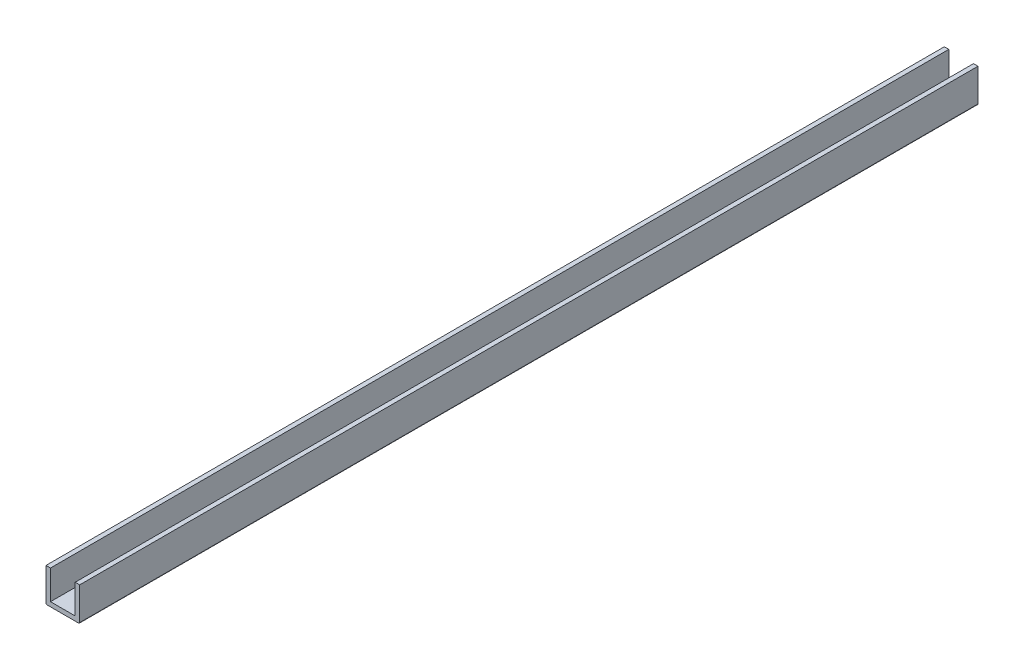
ISO-10303-21;
HEADER;
FILE_DESCRIPTION(('STEP AP214'),'2;1');
FILE_NAME('part.step','',(''),(''),'','','');
FILE_SCHEMA(('AUTOMOTIVE_DESIGN { 1 0 10303 214 1 1 1 1 }'));
ENDSEC;
DATA;
#1=APPLICATION_CONTEXT('core data for automotive mechanical design processes');
#2=APPLICATION_PROTOCOL_DEFINITION('international standard','automotive_design',2000,#1);
#3=PRODUCT_CONTEXT('',#1,'mechanical');
#4=PRODUCT('Part','Part','',(#3));
#5=PRODUCT_RELATED_PRODUCT_CATEGORY('part','',(#4));
#6=PRODUCT_DEFINITION_FORMATION('','',#4);
#7=PRODUCT_DEFINITION_CONTEXT('part definition',#1,'design');
#8=PRODUCT_DEFINITION('design','',#6,#7);
#9=PRODUCT_DEFINITION_SHAPE('','',#8);
#10=(LENGTH_UNIT() NAMED_UNIT(*) SI_UNIT(.MILLI.,.METRE.));
#11=(NAMED_UNIT(*) PLANE_ANGLE_UNIT() SI_UNIT($,.RADIAN.));
#12=(NAMED_UNIT(*) SI_UNIT($,.STERADIAN.) SOLID_ANGLE_UNIT());
#13=UNCERTAINTY_MEASURE_WITH_UNIT(LENGTH_MEASURE(1.E-05),#10,'distance_accuracy_value','');
#14=(GEOMETRIC_REPRESENTATION_CONTEXT(3) GLOBAL_UNCERTAINTY_ASSIGNED_CONTEXT((#13)) GLOBAL_UNIT_ASSIGNED_CONTEXT((#10,
#11,#12)) REPRESENTATION_CONTEXT('',''));
#15=CARTESIAN_POINT('',(0.,0.,0.));
#16=DIRECTION('',(0.,0.,1.));
#17=DIRECTION('',(1.,0.,0.));
#18=AXIS2_PLACEMENT_3D('',#15,#16,#17);
#19=CARTESIAN_POINT('',(-5.5,15.,400.));
#20=DIRECTION('',(0.,-1.,0.));
#21=DIRECTION('',(0.,0.,-1.));
#22=AXIS2_PLACEMENT_3D('',#19,#20,#21);
#23=PLANE('',#22);
#24=DIRECTION('',(-1.,0.,0.));
#25=VECTOR('',#24,1.);
#26=CARTESIAN_POINT('',(-5.5,15.,0.));
#27=LINE('',#26,#25);
#28=CARTESIAN_POINT('',(-5.5,15.,0.));
#29=VERTEX_POINT('',#28);
#30=CARTESIAN_POINT('',(-7.5,15.,0.));
#31=VERTEX_POINT('',#30);
#32=EDGE_CURVE('E131',#29,#31,#27,.T.);
#33=ORIENTED_EDGE('',*,*,#32,.T.);
#34=DIRECTION('',(0.,0.,-1.));
#35=VECTOR('',#34,1.);
#36=CARTESIAN_POINT('',(-7.5,15.,400.));
#37=LINE('',#36,#35);
#38=CARTESIAN_POINT('',(-7.5,15.,400.));
#39=VERTEX_POINT('',#38);
#40=EDGE_CURVE('E114',#39,#31,#37,.T.);
#41=ORIENTED_EDGE('',*,*,#40,.F.);
#42=DIRECTION('',(-1.,0.,0.));
#43=VECTOR('',#42,1.);
#44=CARTESIAN_POINT('',(-5.5,15.,400.));
#45=LINE('',#44,#43);
#46=CARTESIAN_POINT('',(-5.5,15.,400.));
#47=VERTEX_POINT('',#46);
#48=EDGE_CURVE('E119',#47,#39,#45,.T.);
#49=ORIENTED_EDGE('',*,*,#48,.F.);
#50=DIRECTION('',(0.,0.,-1.));
#51=VECTOR('',#50,1.);
#52=CARTESIAN_POINT('',(-5.5,15.,400.));
#53=LINE('',#52,#51);
#54=EDGE_CURVE('E229',#47,#29,#53,.T.);
#55=ORIENTED_EDGE('',*,*,#54,.T.);
#56=EDGE_LOOP('',(#33,#41,#49,#55));
#57=FACE_BOUND('',#56,.T.);
#58=ADVANCED_FACE('F32',(#57),#23,.F.);
#59=CARTESIAN_POINT('',(-7.5,15.,400.));
#60=DIRECTION('',(1.,0.,0.));
#61=DIRECTION('',(0.,1.,0.));
#62=AXIS2_PLACEMENT_3D('',#59,#60,#61);
#63=PLANE('',#62);
#64=DIRECTION('',(0.,-1.,0.));
#65=VECTOR('',#64,1.);
#66=CARTESIAN_POINT('',(-7.5,15.,0.));
#67=LINE('',#66,#65);
#68=CARTESIAN_POINT('',(-7.5,0.5,0.));
#69=VERTEX_POINT('',#68);
#70=EDGE_CURVE('E231',#31,#69,#67,.T.);
#71=ORIENTED_EDGE('',*,*,#70,.T.);
#72=DIRECTION('',(0.,0.,-1.));
#73=VECTOR('',#72,1.);
#74=CARTESIAN_POINT('',(-7.5,0.5,400.));
#75=LINE('',#74,#73);
#76=CARTESIAN_POINT('',(-7.5,0.5,400.));
#77=VERTEX_POINT('',#76);
#78=EDGE_CURVE('E11',#69,#77,#75,.F.);
#79=ORIENTED_EDGE('',*,*,#78,.T.);
#80=DIRECTION('',(0.,-1.,0.));
#81=VECTOR('',#80,1.);
#82=CARTESIAN_POINT('',(-7.5,15.,400.));
#83=LINE('',#82,#81);
#84=EDGE_CURVE('E110',#39,#77,#83,.T.);
#85=ORIENTED_EDGE('',*,*,#84,.F.);
#86=ORIENTED_EDGE('',*,*,#40,.T.);
#87=EDGE_LOOP('',(#71,#79,#85,#86));
#88=FACE_BOUND('',#87,.T.);
#89=ADVANCED_FACE('F112',(#88),#63,.F.);
#90=CARTESIAN_POINT('',(-7.5,0.,400.));
#91=DIRECTION('',(0.,1.,0.));
#92=DIRECTION('',(-1.,0.,0.));
#93=AXIS2_PLACEMENT_3D('',#90,#91,#92);
#94=PLANE('',#93);
#95=CARTESIAN_POINT('',(0.,0.,30.0000000000001));
#96=DIRECTION('',(0.,-1.,0.));
#97=DIRECTION('',(1.,0.,0.));
#98=AXIS2_PLACEMENT_3D('',#95,#96,#97);
#99=CIRCLE('',#98,2.);
#100=CARTESIAN_POINT('',(2.,0.,30.0000000000001));
#101=VERTEX_POINT('',#100);
#102=EDGE_CURVE('E200',#101,#101,#99,.T.);
#103=ORIENTED_EDGE('',*,*,#102,.F.);
#104=EDGE_LOOP('',(#103));
#105=FACE_BOUND('',#104,.T.);
#106=CARTESIAN_POINT('',(0.,0.,80.0000000000001));
#107=DIRECTION('',(0.,-1.,0.));
#108=DIRECTION('',(1.,0.,0.));
#109=AXIS2_PLACEMENT_3D('',#106,#107,#108);
#110=CIRCLE('',#109,2.);
#111=CARTESIAN_POINT('',(2.,0.,80.0000000000001));
#112=VERTEX_POINT('',#111);
#113=EDGE_CURVE('E190',#112,#112,#110,.T.);
#114=ORIENTED_EDGE('',*,*,#113,.F.);
#115=EDGE_LOOP('',(#114));
#116=FACE_BOUND('',#115,.T.);
#117=CARTESIAN_POINT('',(0.,0.,130.));
#118=DIRECTION('',(0.,-1.,0.));
#119=DIRECTION('',(1.,0.,0.));
#120=AXIS2_PLACEMENT_3D('',#117,#118,#119);
#121=CIRCLE('',#120,2.);
#122=CARTESIAN_POINT('',(2.,0.,130.));
#123=VERTEX_POINT('',#122);
#124=EDGE_CURVE('E187',#123,#123,#121,.T.);
#125=ORIENTED_EDGE('',*,*,#124,.F.);
#126=EDGE_LOOP('',(#125));
#127=FACE_BOUND('',#126,.T.);
#128=CARTESIAN_POINT('',(0.,0.,180.));
#129=DIRECTION('',(0.,-1.,0.));
#130=DIRECTION('',(1.,0.,0.));
#131=AXIS2_PLACEMENT_3D('',#128,#129,#130);
#132=CIRCLE('',#131,2.);
#133=CARTESIAN_POINT('',(2.,0.,180.));
#134=VERTEX_POINT('',#133);
#135=EDGE_CURVE('E184',#134,#134,#132,.T.);
#136=ORIENTED_EDGE('',*,*,#135,.F.);
#137=EDGE_LOOP('',(#136));
#138=FACE_BOUND('',#137,.T.);
#139=CARTESIAN_POINT('',(0.,0.,230.));
#140=DIRECTION('',(0.,-1.,0.));
#141=DIRECTION('',(1.,0.,0.));
#142=AXIS2_PLACEMENT_3D('',#139,#140,#141);
#143=CIRCLE('',#142,2.);
#144=CARTESIAN_POINT('',(2.,0.,230.));
#145=VERTEX_POINT('',#144);
#146=EDGE_CURVE('E180',#145,#145,#143,.T.);
#147=ORIENTED_EDGE('',*,*,#146,.F.);
#148=EDGE_LOOP('',(#147));
#149=FACE_BOUND('',#148,.T.);
#150=CARTESIAN_POINT('',(0.,0.,20.));
#151=DIRECTION('',(0.,-1.,0.));
#152=DIRECTION('',(1.,0.,0.));
#153=AXIS2_PLACEMENT_3D('',#150,#151,#152);
#154=CIRCLE('',#153,1.75);
#155=CARTESIAN_POINT('',(1.75,0.,20.));
#156=VERTEX_POINT('',#155);
#157=EDGE_CURVE('E176',#156,#156,#154,.T.);
#158=ORIENTED_EDGE('',*,*,#157,.F.);
#159=EDGE_LOOP('',(#158));
#160=FACE_BOUND('',#159,.T.);
#161=CARTESIAN_POINT('',(0.,0.,380.));
#162=DIRECTION('',(0.,-1.,0.));
#163=DIRECTION('',(1.,0.,0.));
#164=AXIS2_PLACEMENT_3D('',#161,#162,#163);
#165=CIRCLE('',#164,1.75);
#166=CARTESIAN_POINT('',(1.75,0.,380.));
#167=VERTEX_POINT('',#166);
#168=EDGE_CURVE('E172',#167,#167,#165,.T.);
#169=ORIENTED_EDGE('',*,*,#168,.F.);
#170=EDGE_LOOP('',(#169));
#171=FACE_BOUND('',#170,.T.);
#172=CARTESIAN_POINT('',(0.,0.,390.));
#173=DIRECTION('',(0.,-1.,0.));
#174=DIRECTION('',(1.,0.,0.));
#175=AXIS2_PLACEMENT_3D('',#172,#173,#174);
#176=CIRCLE('',#175,1.75);
#177=CARTESIAN_POINT('',(1.75,0.,390.));
#178=VERTEX_POINT('',#177);
#179=EDGE_CURVE('E168',#178,#178,#176,.T.);
#180=ORIENTED_EDGE('',*,*,#179,.F.);
#181=EDGE_LOOP('',(#180));
#182=FACE_BOUND('',#181,.T.);
#183=CARTESIAN_POINT('',(0.,0.,10.));
#184=DIRECTION('',(0.,-1.,0.));
#185=DIRECTION('',(1.,0.,0.));
#186=AXIS2_PLACEMENT_3D('',#183,#184,#185);
#187=CIRCLE('',#186,1.75);
#188=CARTESIAN_POINT('',(1.75,0.,10.));
#189=VERTEX_POINT('',#188);
#190=EDGE_CURVE('E164',#189,#189,#187,.T.);
#191=ORIENTED_EDGE('',*,*,#190,.F.);
#192=EDGE_LOOP('',(#191));
#193=FACE_BOUND('',#192,.T.);
#194=CARTESIAN_POINT('',(0.,0.,330.));
#195=DIRECTION('',(0.,-1.,0.));
#196=DIRECTION('',(1.,0.,0.));
#197=AXIS2_PLACEMENT_3D('',#194,#195,#196);
#198=CIRCLE('',#197,2.);
#199=CARTESIAN_POINT('',(2.,0.,330.));
#200=VERTEX_POINT('',#199);
#201=EDGE_CURVE('E160',#200,#200,#198,.T.);
#202=ORIENTED_EDGE('',*,*,#201,.F.);
#203=EDGE_LOOP('',(#202));
#204=FACE_BOUND('',#203,.T.);
#205=CARTESIAN_POINT('',(0.,0.,280.));
#206=DIRECTION('',(0.,-1.,0.));
#207=DIRECTION('',(1.,0.,0.));
#208=AXIS2_PLACEMENT_3D('',#205,#206,#207);
#209=CIRCLE('',#208,2.);
#210=CARTESIAN_POINT('',(2.,0.,280.));
#211=VERTEX_POINT('',#210);
#212=EDGE_CURVE('E156',#211,#211,#209,.T.);
#213=ORIENTED_EDGE('',*,*,#212,.F.);
#214=EDGE_LOOP('',(#213));
#215=FACE_BOUND('',#214,.T.);
#216=DIRECTION('',(1.,0.,0.));
#217=VECTOR('',#216,1.);
#218=CARTESIAN_POINT('',(-7.5,0.,0.));
#219=LINE('',#218,#217);
#220=CARTESIAN_POINT('',(-7.,0.,0.));
#221=VERTEX_POINT('',#220);
#222=CARTESIAN_POINT('',(7.,0.,0.));
#223=VERTEX_POINT('',#222);
#224=EDGE_CURVE('E233',#221,#223,#219,.T.);
#225=ORIENTED_EDGE('',*,*,#224,.T.);
#226=DIRECTION('',(0.,0.,-1.));
#227=VECTOR('',#226,1.);
#228=CARTESIAN_POINT('',(7.,0.,400.));
#229=LINE('',#228,#227);
#230=CARTESIAN_POINT('',(7.,0.,400.));
#231=VERTEX_POINT('',#230);
#232=EDGE_CURVE('E55',#223,#231,#229,.F.);
#233=ORIENTED_EDGE('',*,*,#232,.T.);
#234=DIRECTION('',(1.,0.,0.));
#235=VECTOR('',#234,1.);
#236=CARTESIAN_POINT('',(-7.5,0.,400.));
#237=LINE('',#236,#235);
#238=CARTESIAN_POINT('',(-7.,0.,400.));
#239=VERTEX_POINT('',#238);
#240=EDGE_CURVE('E118',#239,#231,#237,.T.);
#241=ORIENTED_EDGE('',*,*,#240,.F.);
#242=DIRECTION('',(0.,0.,-1.));
#243=VECTOR('',#242,1.);
#244=CARTESIAN_POINT('',(-7.,0.,400.));
#245=LINE('',#244,#243);
#246=EDGE_CURVE('E146',#239,#221,#245,.T.);
#247=ORIENTED_EDGE('',*,*,#246,.T.);
#248=EDGE_LOOP('',(#225,#233,#241,#247));
#249=FACE_BOUND('',#248,.T.);
#250=ADVANCED_FACE('F275',(#105,#116,#127,#138,#149,#160,#171,#182,#193,#204,#215,#249),#94,.F.);
#251=CARTESIAN_POINT('',(7.5,0.,400.));
#252=DIRECTION('',(-1.,0.,0.));
#253=DIRECTION('',(0.,0.,1.));
#254=AXIS2_PLACEMENT_3D('',#251,#252,#253);
#255=PLANE('',#254);
#256=DIRECTION('',(0.,1.,0.));
#257=VECTOR('',#256,1.);
#258=CARTESIAN_POINT('',(7.5,0.,400.));
#259=LINE('',#258,#257);
#260=CARTESIAN_POINT('',(7.5,0.5,400.));
#261=VERTEX_POINT('',#260);
#262=CARTESIAN_POINT('',(7.5,15.,400.));
#263=VERTEX_POINT('',#262);
#264=EDGE_CURVE('E220',#261,#263,#259,.T.);
#265=ORIENTED_EDGE('',*,*,#264,.F.);
#266=DIRECTION('',(0.,0.,-1.));
#267=VECTOR('',#266,1.);
#268=CARTESIAN_POINT('',(7.5,0.5,400.));
#269=LINE('',#268,#267);
#270=CARTESIAN_POINT('',(7.5,0.5,0.));
#271=VERTEX_POINT('',#270);
#272=EDGE_CURVE('E132',#261,#271,#269,.T.);
#273=ORIENTED_EDGE('',*,*,#272,.T.);
#274=DIRECTION('',(0.,1.,0.));
#275=VECTOR('',#274,1.);
#276=CARTESIAN_POINT('',(7.5,0.,0.));
#277=LINE('',#276,#275);
#278=CARTESIAN_POINT('',(7.5,15.,0.));
#279=VERTEX_POINT('',#278);
#280=EDGE_CURVE('E235',#271,#279,#277,.T.);
#281=ORIENTED_EDGE('',*,*,#280,.T.);
#282=DIRECTION('',(0.,0.,-1.));
#283=VECTOR('',#282,1.);
#284=CARTESIAN_POINT('',(7.5,15.,400.));
#285=LINE('',#284,#283);
#286=EDGE_CURVE('E133',#263,#279,#285,.T.);
#287=ORIENTED_EDGE('',*,*,#286,.F.);
#288=EDGE_LOOP('',(#265,#273,#281,#287));
#289=FACE_BOUND('',#288,.T.);
#290=ADVANCED_FACE('F281',(#289),#255,.F.);
#291=CARTESIAN_POINT('',(7.5,15.,400.));
#292=DIRECTION('',(0.,-1.,0.));
#293=DIRECTION('',(0.,0.,-1.));
#294=AXIS2_PLACEMENT_3D('',#291,#292,#293);
#295=PLANE('',#294);
#296=DIRECTION('',(-1.,0.,0.));
#297=VECTOR('',#296,1.);
#298=CARTESIAN_POINT('',(7.5,15.,0.));
#299=LINE('',#298,#297);
#300=CARTESIAN_POINT('',(5.5,15.,0.));
#301=VERTEX_POINT('',#300);
#302=EDGE_CURVE('E237',#279,#301,#299,.T.);
#303=ORIENTED_EDGE('',*,*,#302,.T.);
#304=DIRECTION('',(0.,0.,-1.));
#305=VECTOR('',#304,1.);
#306=CARTESIAN_POINT('',(5.5,15.,400.));
#307=LINE('',#306,#305);
#308=CARTESIAN_POINT('',(5.5,15.,400.));
#309=VERTEX_POINT('',#308);
#310=EDGE_CURVE('E139',#309,#301,#307,.T.);
#311=ORIENTED_EDGE('',*,*,#310,.F.);
#312=DIRECTION('',(-1.,0.,0.));
#313=VECTOR('',#312,1.);
#314=CARTESIAN_POINT('',(7.5,15.,400.));
#315=LINE('',#314,#313);
#316=EDGE_CURVE('E222',#263,#309,#315,.T.);
#317=ORIENTED_EDGE('',*,*,#316,.F.);
#318=ORIENTED_EDGE('',*,*,#286,.T.);
#319=EDGE_LOOP('',(#303,#311,#317,#318));
#320=FACE_BOUND('',#319,.T.);
#321=ADVANCED_FACE('F283',(#320),#295,.F.);
#322=CARTESIAN_POINT('',(5.5,15.,400.));
#323=DIRECTION('',(1.,0.,0.));
#324=DIRECTION('',(0.,1.,0.));
#325=AXIS2_PLACEMENT_3D('',#322,#323,#324);
#326=PLANE('',#325);
#327=DIRECTION('',(0.,-1.,0.));
#328=VECTOR('',#327,1.);
#329=CARTESIAN_POINT('',(5.5,15.,0.));
#330=LINE('',#329,#328);
#331=CARTESIAN_POINT('',(5.5,2.,0.));
#332=VERTEX_POINT('',#331);
#333=EDGE_CURVE('E239',#301,#332,#330,.T.);
#334=ORIENTED_EDGE('',*,*,#333,.T.);
#335=DIRECTION('',(0.,0.,-1.));
#336=VECTOR('',#335,1.);
#337=CARTESIAN_POINT('',(5.5,2.,400.));
#338=LINE('',#337,#336);
#339=CARTESIAN_POINT('',(5.5,2.,400.));
#340=VERTEX_POINT('',#339);
#341=EDGE_CURVE('E248',#340,#332,#338,.T.);
#342=ORIENTED_EDGE('',*,*,#341,.F.);
#343=DIRECTION('',(0.,-1.,0.));
#344=VECTOR('',#343,1.);
#345=CARTESIAN_POINT('',(5.5,15.,400.));
#346=LINE('',#345,#344);
#347=EDGE_CURVE('E224',#309,#340,#346,.T.);
#348=ORIENTED_EDGE('',*,*,#347,.F.);
#349=ORIENTED_EDGE('',*,*,#310,.T.);
#350=EDGE_LOOP('',(#334,#342,#348,#349));
#351=FACE_BOUND('',#350,.T.);
#352=ADVANCED_FACE('F255',(#351),#326,.F.);
#353=CARTESIAN_POINT('',(5.5,2.,400.));
#354=DIRECTION('',(0.,-1.,0.));
#355=DIRECTION('',(1.,0.,0.));
#356=AXIS2_PLACEMENT_3D('',#353,#354,#355);
#357=PLANE('',#356);
#358=CARTESIAN_POINT('',(0.,2.,30.0000000000001));
#359=DIRECTION('',(0.,-1.,0.));
#360=DIRECTION('',(1.,0.,0.));
#361=AXIS2_PLACEMENT_3D('',#358,#359,#360);
#362=CIRCLE('',#361,2.);
#363=CARTESIAN_POINT('',(2.,2.,30.0000000000001));
#364=VERTEX_POINT('',#363);
#365=EDGE_CURVE('E36',#364,#364,#362,.T.);
#366=ORIENTED_EDGE('',*,*,#365,.T.);
#367=EDGE_LOOP('',(#366));
#368=FACE_BOUND('',#367,.T.);
#369=CARTESIAN_POINT('',(0.,2.,80.0000000000001));
#370=DIRECTION('',(0.,-1.,0.));
#371=DIRECTION('',(1.,0.,0.));
#372=AXIS2_PLACEMENT_3D('',#369,#370,#371);
#373=CIRCLE('',#372,2.);
#374=CARTESIAN_POINT('',(2.,2.,80.0000000000001));
#375=VERTEX_POINT('',#374);
#376=EDGE_CURVE('E188',#375,#375,#373,.T.);
#377=ORIENTED_EDGE('',*,*,#376,.T.);
#378=EDGE_LOOP('',(#377));
#379=FACE_BOUND('',#378,.T.);
#380=CARTESIAN_POINT('',(0.,2.,130.));
#381=DIRECTION('',(0.,-1.,0.));
#382=DIRECTION('',(1.,0.,0.));
#383=AXIS2_PLACEMENT_3D('',#380,#381,#382);
#384=CIRCLE('',#383,2.);
#385=CARTESIAN_POINT('',(2.,2.,130.));
#386=VERTEX_POINT('',#385);
#387=EDGE_CURVE('E185',#386,#386,#384,.T.);
#388=ORIENTED_EDGE('',*,*,#387,.T.);
#389=EDGE_LOOP('',(#388));
#390=FACE_BOUND('',#389,.T.);
#391=CARTESIAN_POINT('',(0.,2.,180.));
#392=DIRECTION('',(0.,-1.,0.));
#393=DIRECTION('',(1.,0.,0.));
#394=AXIS2_PLACEMENT_3D('',#391,#392,#393);
#395=CIRCLE('',#394,2.);
#396=CARTESIAN_POINT('',(2.,2.,180.));
#397=VERTEX_POINT('',#396);
#398=EDGE_CURVE('E181',#397,#397,#395,.T.);
#399=ORIENTED_EDGE('',*,*,#398,.T.);
#400=EDGE_LOOP('',(#399));
#401=FACE_BOUND('',#400,.T.);
#402=CARTESIAN_POINT('',(0.,2.,230.));
#403=DIRECTION('',(0.,-1.,0.));
#404=DIRECTION('',(1.,0.,0.));
#405=AXIS2_PLACEMENT_3D('',#402,#403,#404);
#406=CIRCLE('',#405,2.);
#407=CARTESIAN_POINT('',(2.,2.,230.));
#408=VERTEX_POINT('',#407);
#409=EDGE_CURVE('E177',#408,#408,#406,.T.);
#410=ORIENTED_EDGE('',*,*,#409,.T.);
#411=EDGE_LOOP('',(#410));
#412=FACE_BOUND('',#411,.T.);
#413=CARTESIAN_POINT('',(0.,2.,20.));
#414=DIRECTION('',(0.,-1.,0.));
#415=DIRECTION('',(1.,0.,0.));
#416=AXIS2_PLACEMENT_3D('',#413,#414,#415);
#417=CIRCLE('',#416,1.75);
#418=CARTESIAN_POINT('',(1.75,2.,20.));
#419=VERTEX_POINT('',#418);
#420=EDGE_CURVE('E173',#419,#419,#417,.T.);
#421=ORIENTED_EDGE('',*,*,#420,.T.);
#422=EDGE_LOOP('',(#421));
#423=FACE_BOUND('',#422,.T.);
#424=CARTESIAN_POINT('',(0.,2.,380.));
#425=DIRECTION('',(0.,-1.,0.));
#426=DIRECTION('',(1.,0.,0.));
#427=AXIS2_PLACEMENT_3D('',#424,#425,#426);
#428=CIRCLE('',#427,1.75);
#429=CARTESIAN_POINT('',(1.75,2.,380.));
#430=VERTEX_POINT('',#429);
#431=EDGE_CURVE('E169',#430,#430,#428,.T.);
#432=ORIENTED_EDGE('',*,*,#431,.T.);
#433=EDGE_LOOP('',(#432));
#434=FACE_BOUND('',#433,.T.);
#435=CARTESIAN_POINT('',(0.,2.,390.));
#436=DIRECTION('',(0.,-1.,0.));
#437=DIRECTION('',(1.,0.,0.));
#438=AXIS2_PLACEMENT_3D('',#435,#436,#437);
#439=CIRCLE('',#438,1.75);
#440=CARTESIAN_POINT('',(1.75,2.,390.));
#441=VERTEX_POINT('',#440);
#442=EDGE_CURVE('E165',#441,#441,#439,.T.);
#443=ORIENTED_EDGE('',*,*,#442,.T.);
#444=EDGE_LOOP('',(#443));
#445=FACE_BOUND('',#444,.T.);
#446=CARTESIAN_POINT('',(0.,2.,10.));
#447=DIRECTION('',(0.,-1.,0.));
#448=DIRECTION('',(1.,0.,0.));
#449=AXIS2_PLACEMENT_3D('',#446,#447,#448);
#450=CIRCLE('',#449,1.75);
#451=CARTESIAN_POINT('',(1.75,2.,10.));
#452=VERTEX_POINT('',#451);
#453=EDGE_CURVE('E161',#452,#452,#450,.T.);
#454=ORIENTED_EDGE('',*,*,#453,.T.);
#455=EDGE_LOOP('',(#454));
#456=FACE_BOUND('',#455,.T.);
#457=CARTESIAN_POINT('',(0.,2.,330.));
#458=DIRECTION('',(0.,-1.,0.));
#459=DIRECTION('',(1.,0.,0.));
#460=AXIS2_PLACEMENT_3D('',#457,#458,#459);
#461=CIRCLE('',#460,2.);
#462=CARTESIAN_POINT('',(2.,2.,330.));
#463=VERTEX_POINT('',#462);
#464=EDGE_CURVE('E157',#463,#463,#461,.T.);
#465=ORIENTED_EDGE('',*,*,#464,.T.);
#466=EDGE_LOOP('',(#465));
#467=FACE_BOUND('',#466,.T.);
#468=CARTESIAN_POINT('',(0.,2.,280.));
#469=DIRECTION('',(0.,-1.,0.));
#470=DIRECTION('',(1.,0.,0.));
#471=AXIS2_PLACEMENT_3D('',#468,#469,#470);
#472=CIRCLE('',#471,2.);
#473=CARTESIAN_POINT('',(2.,2.,280.));
#474=VERTEX_POINT('',#473);
#475=EDGE_CURVE('E153',#474,#474,#472,.T.);
#476=ORIENTED_EDGE('',*,*,#475,.T.);
#477=EDGE_LOOP('',(#476));
#478=FACE_BOUND('',#477,.T.);
#479=DIRECTION('',(-1.,0.,0.));
#480=VECTOR('',#479,1.);
#481=CARTESIAN_POINT('',(5.5,2.,0.));
#482=LINE('',#481,#480);
#483=CARTESIAN_POINT('',(-5.5,2.,0.));
#484=VERTEX_POINT('',#483);
#485=EDGE_CURVE('E241',#332,#484,#482,.T.);
#486=ORIENTED_EDGE('',*,*,#485,.T.);
#487=DIRECTION('',(0.,0.,-1.));
#488=VECTOR('',#487,1.);
#489=CARTESIAN_POINT('',(-5.5,2.,400.));
#490=LINE('',#489,#488);
#491=CARTESIAN_POINT('',(-5.5,2.,400.));
#492=VERTEX_POINT('',#491);
#493=EDGE_CURVE('E245',#492,#484,#490,.T.);
#494=ORIENTED_EDGE('',*,*,#493,.F.);
#495=DIRECTION('',(-1.,0.,0.));
#496=VECTOR('',#495,1.);
#497=CARTESIAN_POINT('',(5.5,2.,400.));
#498=LINE('',#497,#496);
#499=EDGE_CURVE('E226',#340,#492,#498,.T.);
#500=ORIENTED_EDGE('',*,*,#499,.F.);
#501=ORIENTED_EDGE('',*,*,#341,.T.);
#502=EDGE_LOOP('',(#486,#494,#500,#501));
#503=FACE_BOUND('',#502,.T.);
#504=ADVANCED_FACE('F267',(#368,#379,#390,#401,#412,#423,#434,#445,#456,#467,#478,#503),#357,.F.);
#505=CARTESIAN_POINT('',(-5.5,2.,400.));
#506=DIRECTION('',(-1.,0.,0.));
#507=DIRECTION('',(0.,0.,1.));
#508=AXIS2_PLACEMENT_3D('',#505,#506,#507);
#509=PLANE('',#508);
#510=DIRECTION('',(0.,1.,0.));
#511=VECTOR('',#510,1.);
#512=CARTESIAN_POINT('',(-5.5,2.,0.));
#513=LINE('',#512,#511);
#514=EDGE_CURVE('E128',#484,#29,#513,.T.);
#515=ORIENTED_EDGE('',*,*,#514,.T.);
#516=ORIENTED_EDGE('',*,*,#54,.F.);
#517=DIRECTION('',(0.,1.,0.));
#518=VECTOR('',#517,1.);
#519=CARTESIAN_POINT('',(-5.5,2.,400.));
#520=LINE('',#519,#518);
#521=EDGE_CURVE('E124',#492,#47,#520,.T.);
#522=ORIENTED_EDGE('',*,*,#521,.F.);
#523=ORIENTED_EDGE('',*,*,#493,.T.);
#524=EDGE_LOOP('',(#515,#516,#522,#523));
#525=FACE_BOUND('',#524,.T.);
#526=ADVANCED_FACE('F270',(#525),#509,.F.);
#527=CARTESIAN_POINT('',(0.,0.,400.));
#528=DIRECTION('',(0.,0.,1.));
#529=DIRECTION('',(1.,0.,0.));
#530=AXIS2_PLACEMENT_3D('',#527,#528,#529);
#531=PLANE('',#530);
#532=ORIENTED_EDGE('',*,*,#240,.T.);
#533=CARTESIAN_POINT('',(7.,0.5,400.));
#534=DIRECTION('',(0.,0.,1.));
#535=DIRECTION('',(1.,0.,0.));
#536=AXIS2_PLACEMENT_3D('',#533,#534,#535);
#537=CIRCLE('',#536,0.5);
#538=EDGE_CURVE('E41',#231,#261,#537,.T.);
#539=ORIENTED_EDGE('',*,*,#538,.T.);
#540=ORIENTED_EDGE('',*,*,#264,.T.);
#541=ORIENTED_EDGE('',*,*,#316,.T.);
#542=ORIENTED_EDGE('',*,*,#347,.T.);
#543=ORIENTED_EDGE('',*,*,#499,.T.);
#544=ORIENTED_EDGE('',*,*,#521,.T.);
#545=ORIENTED_EDGE('',*,*,#48,.T.);
#546=ORIENTED_EDGE('',*,*,#84,.T.);
#547=CARTESIAN_POINT('',(-7.,0.5,400.));
#548=DIRECTION('',(0.,0.,1.));
#549=DIRECTION('',(1.,0.,0.));
#550=AXIS2_PLACEMENT_3D('',#547,#548,#549);
#551=CIRCLE('',#550,0.5);
#552=EDGE_CURVE('E150',#77,#239,#551,.T.);
#553=ORIENTED_EDGE('',*,*,#552,.T.);
#554=EDGE_LOOP('',(#532,#539,#540,#541,#542,#543,#544,#545,#546,#553));
#555=FACE_BOUND('',#554,.T.);
#556=ADVANCED_FACE('F122',(#555),#531,.T.);
#557=CARTESIAN_POINT('',(0.,0.,0.));
#558=DIRECTION('',(0.,0.,1.));
#559=DIRECTION('',(1.,0.,0.));
#560=AXIS2_PLACEMENT_3D('',#557,#558,#559);
#561=PLANE('',#560);
#562=ORIENTED_EDGE('',*,*,#280,.F.);
#563=CARTESIAN_POINT('',(7.,0.5,0.));
#564=DIRECTION('',(0.,0.,1.));
#565=DIRECTION('',(1.,0.,0.));
#566=AXIS2_PLACEMENT_3D('',#563,#564,#565);
#567=CIRCLE('',#566,0.5);
#568=EDGE_CURVE('E144',#271,#223,#567,.F.);
#569=ORIENTED_EDGE('',*,*,#568,.T.);
#570=ORIENTED_EDGE('',*,*,#224,.F.);
#571=CARTESIAN_POINT('',(-7.,0.5,0.));
#572=DIRECTION('',(0.,0.,1.));
#573=DIRECTION('',(1.,0.,0.));
#574=AXIS2_PLACEMENT_3D('',#571,#572,#573);
#575=CIRCLE('',#574,0.5);
#576=EDGE_CURVE('E136',#221,#69,#575,.F.);
#577=ORIENTED_EDGE('',*,*,#576,.T.);
#578=ORIENTED_EDGE('',*,*,#70,.F.);
#579=ORIENTED_EDGE('',*,*,#32,.F.);
#580=ORIENTED_EDGE('',*,*,#514,.F.);
#581=ORIENTED_EDGE('',*,*,#485,.F.);
#582=ORIENTED_EDGE('',*,*,#333,.F.);
#583=ORIENTED_EDGE('',*,*,#302,.F.);
#584=EDGE_LOOP('',(#562,#569,#570,#577,#578,#579,#580,#581,#582,#583));
#585=FACE_BOUND('',#584,.T.);
#586=ADVANCED_FACE('F263',(#585),#561,.F.);
#587=CARTESIAN_POINT('',(7.,0.5,400.));
#588=DIRECTION('',(0.,0.,-1.));
#589=DIRECTION('',(-1.,0.,0.));
#590=AXIS2_PLACEMENT_3D('',#587,#588,#589);
#591=CYLINDRICAL_SURFACE('',#590,0.5);
#592=ORIENTED_EDGE('',*,*,#538,.F.);
#593=ORIENTED_EDGE('',*,*,#232,.F.);
#594=ORIENTED_EDGE('',*,*,#568,.F.);
#595=ORIENTED_EDGE('',*,*,#272,.F.);
#596=EDGE_LOOP('',(#592,#593,#594,#595));
#597=FACE_BOUND('',#596,.T.);
#598=ADVANCED_FACE('F278',(#597),#591,.T.);
#599=CARTESIAN_POINT('',(-7.,0.5,400.));
#600=DIRECTION('',(0.,0.,-1.));
#601=DIRECTION('',(-1.,0.,0.));
#602=AXIS2_PLACEMENT_3D('',#599,#600,#601);
#603=CYLINDRICAL_SURFACE('',#602,0.5);
#604=ORIENTED_EDGE('',*,*,#552,.F.);
#605=ORIENTED_EDGE('',*,*,#78,.F.);
#606=ORIENTED_EDGE('',*,*,#576,.F.);
#607=ORIENTED_EDGE('',*,*,#246,.F.);
#608=EDGE_LOOP('',(#604,#605,#606,#607));
#609=FACE_BOUND('',#608,.T.);
#610=ADVANCED_FACE('F34',(#609),#603,.T.);
#611=CARTESIAN_POINT('',(0.,15.,280.));
#612=DIRECTION('',(0.,-1.,0.));
#613=DIRECTION('',(1.,0.,0.));
#614=AXIS2_PLACEMENT_3D('',#611,#612,#613);
#615=CYLINDRICAL_SURFACE('',#614,2.);
#616=ORIENTED_EDGE('',*,*,#212,.T.);
#617=EDGE_LOOP('',(#616));
#618=FACE_BOUND('',#617,.T.);
#619=ORIENTED_EDGE('',*,*,#475,.F.);
#620=EDGE_LOOP('',(#619));
#621=FACE_BOUND('',#620,.T.);
#622=ADVANCED_FACE('F304',(#618,#621),#615,.F.);
#623=CARTESIAN_POINT('',(0.,15.,330.));
#624=DIRECTION('',(0.,-1.,0.));
#625=DIRECTION('',(1.,0.,0.));
#626=AXIS2_PLACEMENT_3D('',#623,#624,#625);
#627=CYLINDRICAL_SURFACE('',#626,2.);
#628=ORIENTED_EDGE('',*,*,#201,.T.);
#629=EDGE_LOOP('',(#628));
#630=FACE_BOUND('',#629,.T.);
#631=ORIENTED_EDGE('',*,*,#464,.F.);
#632=EDGE_LOOP('',(#631));
#633=FACE_BOUND('',#632,.T.);
#634=ADVANCED_FACE('F339',(#630,#633),#627,.F.);
#635=CARTESIAN_POINT('',(0.,15.,10.));
#636=DIRECTION('',(0.,-1.,0.));
#637=DIRECTION('',(1.,0.,0.));
#638=AXIS2_PLACEMENT_3D('',#635,#636,#637);
#639=CYLINDRICAL_SURFACE('',#638,1.75);
#640=ORIENTED_EDGE('',*,*,#190,.T.);
#641=EDGE_LOOP('',(#640));
#642=FACE_BOUND('',#641,.T.);
#643=ORIENTED_EDGE('',*,*,#453,.F.);
#644=EDGE_LOOP('',(#643));
#645=FACE_BOUND('',#644,.T.);
#646=ADVANCED_FACE('F344',(#642,#645),#639,.F.);
#647=CARTESIAN_POINT('',(0.,15.,390.));
#648=DIRECTION('',(0.,-1.,0.));
#649=DIRECTION('',(1.,0.,0.));
#650=AXIS2_PLACEMENT_3D('',#647,#648,#649);
#651=CYLINDRICAL_SURFACE('',#650,1.75);
#652=ORIENTED_EDGE('',*,*,#179,.T.);
#653=EDGE_LOOP('',(#652));
#654=FACE_BOUND('',#653,.T.);
#655=ORIENTED_EDGE('',*,*,#442,.F.);
#656=EDGE_LOOP('',(#655));
#657=FACE_BOUND('',#656,.T.);
#658=ADVANCED_FACE('F350',(#654,#657),#651,.F.);
#659=CARTESIAN_POINT('',(0.,15.,380.));
#660=DIRECTION('',(0.,-1.,0.));
#661=DIRECTION('',(1.,0.,0.));
#662=AXIS2_PLACEMENT_3D('',#659,#660,#661);
#663=CYLINDRICAL_SURFACE('',#662,1.75);
#664=ORIENTED_EDGE('',*,*,#168,.T.);
#665=EDGE_LOOP('',(#664));
#666=FACE_BOUND('',#665,.T.);
#667=ORIENTED_EDGE('',*,*,#431,.F.);
#668=EDGE_LOOP('',(#667));
#669=FACE_BOUND('',#668,.T.);
#670=ADVANCED_FACE('F354',(#666,#669),#663,.F.);
#671=CARTESIAN_POINT('',(0.,15.,20.));
#672=DIRECTION('',(0.,-1.,0.));
#673=DIRECTION('',(1.,0.,0.));
#674=AXIS2_PLACEMENT_3D('',#671,#672,#673);
#675=CYLINDRICAL_SURFACE('',#674,1.75);
#676=ORIENTED_EDGE('',*,*,#157,.T.);
#677=EDGE_LOOP('',(#676));
#678=FACE_BOUND('',#677,.T.);
#679=ORIENTED_EDGE('',*,*,#420,.F.);
#680=EDGE_LOOP('',(#679));
#681=FACE_BOUND('',#680,.T.);
#682=ADVANCED_FACE('F358',(#678,#681),#675,.F.);
#683=CARTESIAN_POINT('',(0.,15.,230.));
#684=DIRECTION('',(0.,-1.,0.));
#685=DIRECTION('',(1.,0.,0.));
#686=AXIS2_PLACEMENT_3D('',#683,#684,#685);
#687=CYLINDRICAL_SURFACE('',#686,2.);
#688=ORIENTED_EDGE('',*,*,#146,.T.);
#689=EDGE_LOOP('',(#688));
#690=FACE_BOUND('',#689,.T.);
#691=ORIENTED_EDGE('',*,*,#409,.F.);
#692=EDGE_LOOP('',(#691));
#693=FACE_BOUND('',#692,.T.);
#694=ADVANCED_FACE('F362',(#690,#693),#687,.F.);
#695=CARTESIAN_POINT('',(0.,15.,180.));
#696=DIRECTION('',(0.,-1.,0.));
#697=DIRECTION('',(1.,0.,0.));
#698=AXIS2_PLACEMENT_3D('',#695,#696,#697);
#699=CYLINDRICAL_SURFACE('',#698,2.);
#700=ORIENTED_EDGE('',*,*,#135,.T.);
#701=EDGE_LOOP('',(#700));
#702=FACE_BOUND('',#701,.T.);
#703=ORIENTED_EDGE('',*,*,#398,.F.);
#704=EDGE_LOOP('',(#703));
#705=FACE_BOUND('',#704,.T.);
#706=ADVANCED_FACE('F366',(#702,#705),#699,.F.);
#707=CARTESIAN_POINT('',(0.,15.,130.));
#708=DIRECTION('',(0.,-1.,0.));
#709=DIRECTION('',(1.,0.,0.));
#710=AXIS2_PLACEMENT_3D('',#707,#708,#709);
#711=CYLINDRICAL_SURFACE('',#710,2.);
#712=ORIENTED_EDGE('',*,*,#124,.T.);
#713=EDGE_LOOP('',(#712));
#714=FACE_BOUND('',#713,.T.);
#715=ORIENTED_EDGE('',*,*,#387,.F.);
#716=EDGE_LOOP('',(#715));
#717=FACE_BOUND('',#716,.T.);
#718=ADVANCED_FACE('F370',(#714,#717),#711,.F.);
#719=CARTESIAN_POINT('',(0.,15.,80.0000000000001));
#720=DIRECTION('',(0.,-1.,0.));
#721=DIRECTION('',(1.,0.,0.));
#722=AXIS2_PLACEMENT_3D('',#719,#720,#721);
#723=CYLINDRICAL_SURFACE('',#722,2.);
#724=ORIENTED_EDGE('',*,*,#113,.T.);
#725=EDGE_LOOP('',(#724));
#726=FACE_BOUND('',#725,.T.);
#727=ORIENTED_EDGE('',*,*,#376,.F.);
#728=EDGE_LOOP('',(#727));
#729=FACE_BOUND('',#728,.T.);
#730=ADVANCED_FACE('F374',(#726,#729),#723,.F.);
#731=CARTESIAN_POINT('',(0.,15.,30.0000000000001));
#732=DIRECTION('',(0.,-1.,0.));
#733=DIRECTION('',(1.,0.,0.));
#734=AXIS2_PLACEMENT_3D('',#731,#732,#733);
#735=CYLINDRICAL_SURFACE('',#734,2.);
#736=ORIENTED_EDGE('',*,*,#102,.T.);
#737=EDGE_LOOP('',(#736));
#738=FACE_BOUND('',#737,.T.);
#739=ORIENTED_EDGE('',*,*,#365,.F.);
#740=EDGE_LOOP('',(#739));
#741=FACE_BOUND('',#740,.T.);
#742=ADVANCED_FACE('F378',(#738,#741),#735,.F.);
#743=CLOSED_SHELL('',(#58,#89,#250,#290,#321,#352,#504,#526,#556,#586,#598,#610,#622,#634,#646,
#658,#670,#682,#694,#706,#718,#730,#742));
#744=MANIFOLD_SOLID_BREP('B2',#743);
#745=ADVANCED_BREP_SHAPE_REPRESENTATION('',(#18,#744),#14);
#746=SHAPE_DEFINITION_REPRESENTATION(#9,#745);
ENDSEC;
END-ISO-10303-21;
